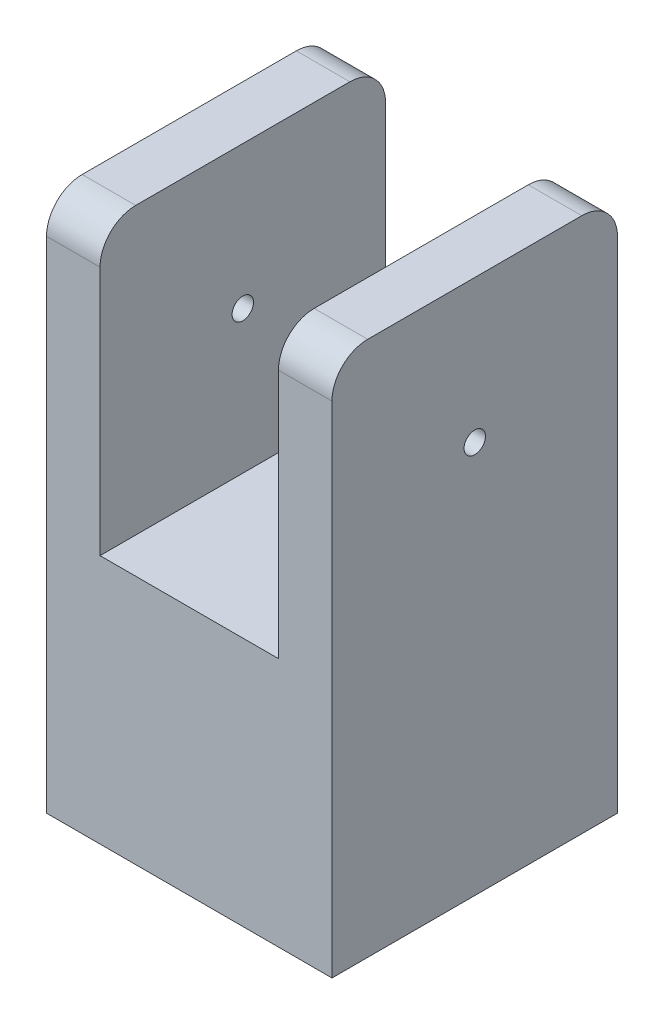
ISO-10303-21;
HEADER;
FILE_DESCRIPTION(('STEP AP214'),'2;1');
FILE_NAME('part.step','',(''),(''),'','','');
FILE_SCHEMA(('AUTOMOTIVE_DESIGN { 1 0 10303 214 1 1 1 1 }'));
ENDSEC;
DATA;
#1=APPLICATION_CONTEXT('core data for automotive mechanical design processes');
#2=APPLICATION_PROTOCOL_DEFINITION('international standard','automotive_design',2000,#1);
#3=PRODUCT_CONTEXT('',#1,'mechanical');
#4=PRODUCT('Part','Part','',(#3));
#5=PRODUCT_RELATED_PRODUCT_CATEGORY('part','',(#4));
#6=PRODUCT_DEFINITION_FORMATION('','',#4);
#7=PRODUCT_DEFINITION_CONTEXT('part definition',#1,'design');
#8=PRODUCT_DEFINITION('design','',#6,#7);
#9=PRODUCT_DEFINITION_SHAPE('','',#8);
#10=(LENGTH_UNIT() NAMED_UNIT(*) SI_UNIT(.MILLI.,.METRE.));
#11=(NAMED_UNIT(*) PLANE_ANGLE_UNIT() SI_UNIT($,.RADIAN.));
#12=(NAMED_UNIT(*) SI_UNIT($,.STERADIAN.) SOLID_ANGLE_UNIT());
#13=UNCERTAINTY_MEASURE_WITH_UNIT(LENGTH_MEASURE(1.E-05),#10,'distance_accuracy_value','');
#14=(GEOMETRIC_REPRESENTATION_CONTEXT(3) GLOBAL_UNCERTAINTY_ASSIGNED_CONTEXT((#13)) GLOBAL_UNIT_ASSIGNED_CONTEXT((#10,
#11,#12)) REPRESENTATION_CONTEXT('',''));
#15=CARTESIAN_POINT('',(0.,0.,0.));
#16=DIRECTION('',(0.,0.,1.));
#17=DIRECTION('',(1.,0.,0.));
#18=AXIS2_PLACEMENT_3D('',#15,#16,#17);
#19=CARTESIAN_POINT('',(0.,150.,0.));
#20=DIRECTION('',(0.,-1.,0.));
#21=DIRECTION('',(0.,0.,-1.));
#22=AXIS2_PLACEMENT_3D('',#19,#20,#21);
#23=PLANE('',#22);
#24=DIRECTION('',(0.,0.,1.));
#25=VECTOR('',#24,1.);
#26=CARTESIAN_POINT('',(-25.,150.,40.));
#27=LINE('',#26,#25);
#28=CARTESIAN_POINT('',(-25.,150.,-30.));
#29=VERTEX_POINT('',#28);
#30=CARTESIAN_POINT('',(-25.,150.,30.));
#31=VERTEX_POINT('',#30);
#32=EDGE_CURVE('E278',#29,#31,#27,.T.);
#33=ORIENTED_EDGE('',*,*,#32,.F.);
#34=DIRECTION('',(-1.,0.,0.));
#35=VECTOR('',#34,1.);
#36=CARTESIAN_POINT('',(0.,150.,-30.));
#37=LINE('',#36,#35);
#38=CARTESIAN_POINT('',(-40.,150.,-30.));
#39=VERTEX_POINT('',#38);
#40=EDGE_CURVE('E223',#29,#39,#37,.T.);
#41=ORIENTED_EDGE('',*,*,#40,.T.);
#42=DIRECTION('',(0.,0.,1.));
#43=VECTOR('',#42,1.);
#44=CARTESIAN_POINT('',(-40.,150.,40.));
#45=LINE('',#44,#43);
#46=CARTESIAN_POINT('',(-40.,150.,30.));
#47=VERTEX_POINT('',#46);
#48=EDGE_CURVE('E186',#39,#47,#45,.T.);
#49=ORIENTED_EDGE('',*,*,#48,.T.);
#50=DIRECTION('',(1.,0.,0.));
#51=VECTOR('',#50,1.);
#52=CARTESIAN_POINT('',(0.,150.,30.));
#53=LINE('',#52,#51);
#54=EDGE_CURVE('E211',#47,#31,#53,.T.);
#55=ORIENTED_EDGE('',*,*,#54,.T.);
#56=EDGE_LOOP('',(#33,#41,#49,#55));
#57=FACE_BOUND('',#56,.T.);
#58=ADVANCED_FACE('F47',(#57),#23,.F.);
#59=CARTESIAN_POINT('',(0.,150.,0.));
#60=DIRECTION('',(0.,-1.,0.));
#61=DIRECTION('',(0.,0.,-1.));
#62=AXIS2_PLACEMENT_3D('',#59,#60,#61);
#63=CYLINDRICAL_SURFACE('',#62,3.);
#64=CARTESIAN_POINT('',(0.,0.,0.));
#65=DIRECTION('',(0.,1.,0.));
#66=DIRECTION('',(0.,0.,1.));
#67=AXIS2_PLACEMENT_3D('',#64,#65,#66);
#68=CIRCLE('',#67,3.);
#69=CARTESIAN_POINT('',(0.,0.,3.));
#70=VERTEX_POINT('',#69);
#71=EDGE_CURVE('E177',#70,#70,#68,.T.);
#72=ORIENTED_EDGE('',*,*,#71,.F.);
#73=EDGE_LOOP('',(#72));
#74=FACE_BOUND('',#73,.T.);
#75=CARTESIAN_POINT('',(0.,70.,0.));
#76=DIRECTION('',(0.,1.,0.));
#77=DIRECTION('',(0.,0.,1.));
#78=AXIS2_PLACEMENT_3D('',#75,#76,#77);
#79=CIRCLE('',#78,3.);
#80=CARTESIAN_POINT('',(0.,70.,3.));
#81=VERTEX_POINT('',#80);
#82=EDGE_CURVE('E181',#81,#81,#79,.T.);
#83=ORIENTED_EDGE('',*,*,#82,.T.);
#84=EDGE_LOOP('',(#83));
#85=FACE_BOUND('',#84,.T.);
#86=ADVANCED_FACE('F315',(#74,#85),#63,.F.);
#87=DIRECTION('',(0.,0.,-1.));
#88=VECTOR('',#87,1.);
#89=CARTESIAN_POINT('',(40.,150.,40.));
#90=LINE('',#89,#88);
#91=CARTESIAN_POINT('',(40.,150.,30.));
#92=VERTEX_POINT('',#91);
#93=CARTESIAN_POINT('',(40.,150.,-30.));
#94=VERTEX_POINT('',#93);
#95=EDGE_CURVE('E182',#92,#94,#90,.T.);
#96=ORIENTED_EDGE('',*,*,#95,.T.);
#97=DIRECTION('',(-1.,0.,0.));
#98=VECTOR('',#97,1.);
#99=CARTESIAN_POINT('',(0.,150.,-30.));
#100=LINE('',#99,#98);
#101=CARTESIAN_POINT('',(25.,150.,-30.));
#102=VERTEX_POINT('',#101);
#103=EDGE_CURVE('E244',#94,#102,#100,.T.);
#104=ORIENTED_EDGE('',*,*,#103,.T.);
#105=DIRECTION('',(0.,0.,-1.));
#106=VECTOR('',#105,1.);
#107=CARTESIAN_POINT('',(25.,150.,40.));
#108=LINE('',#107,#106);
#109=CARTESIAN_POINT('',(25.,150.,30.));
#110=VERTEX_POINT('',#109);
#111=EDGE_CURVE('E268',#110,#102,#108,.T.);
#112=ORIENTED_EDGE('',*,*,#111,.F.);
#113=DIRECTION('',(1.,0.,0.));
#114=VECTOR('',#113,1.);
#115=CARTESIAN_POINT('',(0.,150.,30.));
#116=LINE('',#115,#114);
#117=EDGE_CURVE('E241',#110,#92,#116,.T.);
#118=ORIENTED_EDGE('',*,*,#117,.T.);
#119=EDGE_LOOP('',(#96,#104,#112,#118));
#120=FACE_BOUND('',#119,.T.);
#121=ADVANCED_FACE('F264',(#120),#23,.F.);
#122=CARTESIAN_POINT('',(0.,0.,0.));
#123=DIRECTION('',(0.,-1.,0.));
#124=DIRECTION('',(0.,0.,-1.));
#125=AXIS2_PLACEMENT_3D('',#122,#123,#124);
#126=PLANE('',#125);
#127=DIRECTION('',(0.,0.,-1.));
#128=VECTOR('',#127,1.);
#129=CARTESIAN_POINT('',(40.,0.,40.));
#130=LINE('',#129,#128);
#131=CARTESIAN_POINT('',(40.,0.,40.));
#132=VERTEX_POINT('',#131);
#133=CARTESIAN_POINT('',(40.,0.,-40.));
#134=VERTEX_POINT('',#133);
#135=EDGE_CURVE('E180',#132,#134,#130,.T.);
#136=ORIENTED_EDGE('',*,*,#135,.F.);
#137=DIRECTION('',(1.,0.,0.));
#138=VECTOR('',#137,1.);
#139=CARTESIAN_POINT('',(-40.,0.,40.));
#140=LINE('',#139,#138);
#141=CARTESIAN_POINT('',(-40.,0.,40.));
#142=VERTEX_POINT('',#141);
#143=EDGE_CURVE('E187',#142,#132,#140,.T.);
#144=ORIENTED_EDGE('',*,*,#143,.F.);
#145=DIRECTION('',(0.,0.,1.));
#146=VECTOR('',#145,1.);
#147=CARTESIAN_POINT('',(-40.,0.,40.));
#148=LINE('',#147,#146);
#149=CARTESIAN_POINT('',(-40.,0.,-40.));
#150=VERTEX_POINT('',#149);
#151=EDGE_CURVE('E197',#150,#142,#148,.T.);
#152=ORIENTED_EDGE('',*,*,#151,.F.);
#153=DIRECTION('',(-1.,0.,0.));
#154=VECTOR('',#153,1.);
#155=CARTESIAN_POINT('',(-40.,0.,-40.));
#156=LINE('',#155,#154);
#157=EDGE_CURVE('E194',#134,#150,#156,.T.);
#158=ORIENTED_EDGE('',*,*,#157,.F.);
#159=EDGE_LOOP('',(#136,#144,#152,#158));
#160=FACE_BOUND('',#159,.T.);
#161=ORIENTED_EDGE('',*,*,#71,.T.);
#162=EDGE_LOOP('',(#161));
#163=FACE_BOUND('',#162,.T.);
#164=ADVANCED_FACE('F307',(#160,#163),#126,.T.);
#165=CARTESIAN_POINT('',(40.,150.,40.));
#166=DIRECTION('',(-1.,0.,0.));
#167=DIRECTION('',(0.,0.,1.));
#168=AXIS2_PLACEMENT_3D('',#165,#166,#167);
#169=PLANE('',#168);
#170=CARTESIAN_POINT('',(40.,110.,0.));
#171=DIRECTION('',(-1.,0.,0.));
#172=DIRECTION('',(0.,0.,1.));
#173=AXIS2_PLACEMENT_3D('',#170,#171,#172);
#174=CIRCLE('',#173,3.);
#175=CARTESIAN_POINT('',(40.,110.,3.));
#176=VERTEX_POINT('',#175);
#177=EDGE_CURVE('E281',#176,#176,#174,.T.);
#178=ORIENTED_EDGE('',*,*,#177,.T.);
#179=EDGE_LOOP('',(#178));
#180=FACE_BOUND('',#179,.T.);
#181=DIRECTION('',(0.,-1.,0.));
#182=VECTOR('',#181,1.);
#183=CARTESIAN_POINT('',(40.,150.,-40.));
#184=LINE('',#183,#182);
#185=CARTESIAN_POINT('',(40.,140.,-40.));
#186=VERTEX_POINT('',#185);
#187=EDGE_CURVE('E208',#186,#134,#184,.T.);
#188=ORIENTED_EDGE('',*,*,#187,.F.);
#189=CARTESIAN_POINT('',(40.,140.,-30.));
#190=DIRECTION('',(-1.,0.,0.));
#191=DIRECTION('',(0.,0.,1.));
#192=AXIS2_PLACEMENT_3D('',#189,#190,#191);
#193=CIRCLE('',#192,10.);
#194=EDGE_CURVE('E254',#186,#94,#193,.F.);
#195=ORIENTED_EDGE('',*,*,#194,.T.);
#196=ORIENTED_EDGE('',*,*,#95,.F.);
#197=CARTESIAN_POINT('',(40.,140.,30.));
#198=DIRECTION('',(-1.,0.,0.));
#199=DIRECTION('',(0.,0.,1.));
#200=AXIS2_PLACEMENT_3D('',#197,#198,#199);
#201=CIRCLE('',#200,10.);
#202=CARTESIAN_POINT('',(40.,140.,40.));
#203=VERTEX_POINT('',#202);
#204=EDGE_CURVE('E63',#92,#203,#201,.F.);
#205=ORIENTED_EDGE('',*,*,#204,.T.);
#206=DIRECTION('',(0.,-1.,0.));
#207=VECTOR('',#206,1.);
#208=CARTESIAN_POINT('',(40.,150.,40.));
#209=LINE('',#208,#207);
#210=EDGE_CURVE('E191',#203,#132,#209,.T.);
#211=ORIENTED_EDGE('',*,*,#210,.T.);
#212=ORIENTED_EDGE('',*,*,#135,.T.);
#213=EDGE_LOOP('',(#188,#195,#196,#205,#211,#212));
#214=FACE_BOUND('',#213,.T.);
#215=ADVANCED_FACE('F259',(#180,#214),#169,.F.);
#216=CARTESIAN_POINT('',(-40.,150.,-40.));
#217=DIRECTION('',(0.,0.,1.));
#218=DIRECTION('',(1.,0.,0.));
#219=AXIS2_PLACEMENT_3D('',#216,#217,#218);
#220=PLANE('',#219);
#221=DIRECTION('',(0.,-1.,0.));
#222=VECTOR('',#221,1.);
#223=CARTESIAN_POINT('',(-40.,150.,-40.));
#224=LINE('',#223,#222);
#225=CARTESIAN_POINT('',(-40.,140.,-40.));
#226=VERTEX_POINT('',#225);
#227=EDGE_CURVE('E205',#226,#150,#224,.T.);
#228=ORIENTED_EDGE('',*,*,#227,.F.);
#229=DIRECTION('',(-1.,0.,0.));
#230=VECTOR('',#229,1.);
#231=CARTESIAN_POINT('',(-40.,140.,-40.));
#232=LINE('',#231,#230);
#233=CARTESIAN_POINT('',(-25.,140.,-40.));
#234=VERTEX_POINT('',#233);
#235=EDGE_CURVE('E234',#226,#234,#232,.F.);
#236=ORIENTED_EDGE('',*,*,#235,.T.);
#237=DIRECTION('',(0.,1.,0.));
#238=VECTOR('',#237,1.);
#239=CARTESIAN_POINT('',(-25.,70.,-40.));
#240=LINE('',#239,#238);
#241=CARTESIAN_POINT('',(-25.,70.,-40.));
#242=VERTEX_POINT('',#241);
#243=EDGE_CURVE('E171',#242,#234,#240,.T.);
#244=ORIENTED_EDGE('',*,*,#243,.F.);
#245=DIRECTION('',(-1.,0.,0.));
#246=VECTOR('',#245,1.);
#247=CARTESIAN_POINT('',(25.,70.,-40.));
#248=LINE('',#247,#246);
#249=CARTESIAN_POINT('',(25.,70.,-40.));
#250=VERTEX_POINT('',#249);
#251=EDGE_CURVE('E155',#250,#242,#248,.T.);
#252=ORIENTED_EDGE('',*,*,#251,.F.);
#253=DIRECTION('',(0.,1.,0.));
#254=VECTOR('',#253,1.);
#255=CARTESIAN_POINT('',(25.,70.,-40.));
#256=LINE('',#255,#254);
#257=CARTESIAN_POINT('',(25.,140.,-40.));
#258=VERTEX_POINT('',#257);
#259=EDGE_CURVE('E150',#250,#258,#256,.T.);
#260=ORIENTED_EDGE('',*,*,#259,.T.);
#261=DIRECTION('',(-1.,0.,0.));
#262=VECTOR('',#261,1.);
#263=CARTESIAN_POINT('',(-40.,140.,-40.));
#264=LINE('',#263,#262);
#265=EDGE_CURVE('E231',#258,#186,#264,.F.);
#266=ORIENTED_EDGE('',*,*,#265,.T.);
#267=ORIENTED_EDGE('',*,*,#187,.T.);
#268=ORIENTED_EDGE('',*,*,#157,.T.);
#269=EDGE_LOOP('',(#228,#236,#244,#252,#260,#266,#267,#268));
#270=FACE_BOUND('',#269,.T.);
#271=ADVANCED_FACE('F271',(#270),#220,.F.);
#272=CARTESIAN_POINT('',(-40.,150.,40.));
#273=DIRECTION('',(1.,0.,0.));
#274=DIRECTION('',(0.,0.,-1.));
#275=AXIS2_PLACEMENT_3D('',#272,#273,#274);
#276=PLANE('',#275);
#277=CARTESIAN_POINT('',(-40.,110.,0.));
#278=DIRECTION('',(1.,0.,0.));
#279=DIRECTION('',(0.,0.,-1.));
#280=AXIS2_PLACEMENT_3D('',#277,#278,#279);
#281=CIRCLE('',#280,3.);
#282=CARTESIAN_POINT('',(-40.,110.,-3.));
#283=VERTEX_POINT('',#282);
#284=EDGE_CURVE('E219',#283,#283,#281,.T.);
#285=ORIENTED_EDGE('',*,*,#284,.T.);
#286=EDGE_LOOP('',(#285));
#287=FACE_BOUND('',#286,.T.);
#288=ORIENTED_EDGE('',*,*,#48,.F.);
#289=CARTESIAN_POINT('',(-40.,140.,-30.));
#290=DIRECTION('',(1.,0.,0.));
#291=DIRECTION('',(0.,0.,-1.));
#292=AXIS2_PLACEMENT_3D('',#289,#290,#291);
#293=CIRCLE('',#292,10.);
#294=EDGE_CURVE('E229',#39,#226,#293,.F.);
#295=ORIENTED_EDGE('',*,*,#294,.T.);
#296=ORIENTED_EDGE('',*,*,#227,.T.);
#297=ORIENTED_EDGE('',*,*,#151,.T.);
#298=DIRECTION('',(0.,-1.,0.));
#299=VECTOR('',#298,1.);
#300=CARTESIAN_POINT('',(-40.,150.,40.));
#301=LINE('',#300,#299);
#302=CARTESIAN_POINT('',(-40.,140.,40.));
#303=VERTEX_POINT('',#302);
#304=EDGE_CURVE('E203',#303,#142,#301,.T.);
#305=ORIENTED_EDGE('',*,*,#304,.F.);
#306=CARTESIAN_POINT('',(-40.,140.,30.));
#307=DIRECTION('',(1.,0.,0.));
#308=DIRECTION('',(0.,0.,-1.));
#309=AXIS2_PLACEMENT_3D('',#306,#307,#308);
#310=CIRCLE('',#309,10.);
#311=EDGE_CURVE('E226',#303,#47,#310,.F.);
#312=ORIENTED_EDGE('',*,*,#311,.T.);
#313=EDGE_LOOP('',(#288,#295,#296,#297,#305,#312));
#314=FACE_BOUND('',#313,.T.);
#315=ADVANCED_FACE('F296',(#287,#314),#276,.F.);
#316=CARTESIAN_POINT('',(-40.,150.,40.));
#317=DIRECTION('',(0.,0.,-1.));
#318=DIRECTION('',(-1.,0.,0.));
#319=AXIS2_PLACEMENT_3D('',#316,#317,#318);
#320=PLANE('',#319);
#321=DIRECTION('',(0.,1.,0.));
#322=VECTOR('',#321,1.);
#323=CARTESIAN_POINT('',(-25.,70.,40.));
#324=LINE('',#323,#322);
#325=CARTESIAN_POINT('',(-25.,70.,40.));
#326=VERTEX_POINT('',#325);
#327=CARTESIAN_POINT('',(-25.,140.,40.));
#328=VERTEX_POINT('',#327);
#329=EDGE_CURVE('E167',#326,#328,#324,.T.);
#330=ORIENTED_EDGE('',*,*,#329,.T.);
#331=DIRECTION('',(1.,0.,0.));
#332=VECTOR('',#331,1.);
#333=CARTESIAN_POINT('',(-40.,140.,40.));
#334=LINE('',#333,#332);
#335=EDGE_CURVE('E11',#328,#303,#334,.F.);
#336=ORIENTED_EDGE('',*,*,#335,.T.);
#337=ORIENTED_EDGE('',*,*,#304,.T.);
#338=ORIENTED_EDGE('',*,*,#143,.T.);
#339=ORIENTED_EDGE('',*,*,#210,.F.);
#340=DIRECTION('',(1.,0.,0.));
#341=VECTOR('',#340,1.);
#342=CARTESIAN_POINT('',(-40.,140.,40.));
#343=LINE('',#342,#341);
#344=CARTESIAN_POINT('',(25.,140.,40.));
#345=VERTEX_POINT('',#344);
#346=EDGE_CURVE('E56',#203,#345,#343,.F.);
#347=ORIENTED_EDGE('',*,*,#346,.T.);
#348=DIRECTION('',(0.,1.,0.));
#349=VECTOR('',#348,1.);
#350=CARTESIAN_POINT('',(25.,70.,40.));
#351=LINE('',#350,#349);
#352=CARTESIAN_POINT('',(25.,70.,40.));
#353=VERTEX_POINT('',#352);
#354=EDGE_CURVE('E147',#353,#345,#351,.T.);
#355=ORIENTED_EDGE('',*,*,#354,.F.);
#356=DIRECTION('',(1.,0.,0.));
#357=VECTOR('',#356,1.);
#358=CARTESIAN_POINT('',(25.,70.,40.));
#359=LINE('',#358,#357);
#360=EDGE_CURVE('E156',#326,#353,#359,.T.);
#361=ORIENTED_EDGE('',*,*,#360,.F.);
#362=EDGE_LOOP('',(#330,#336,#337,#338,#339,#347,#355,#361));
#363=FACE_BOUND('',#362,.T.);
#364=ADVANCED_FACE('F165',(#363),#320,.F.);
#365=CARTESIAN_POINT('',(-25.,70.,40.));
#366=DIRECTION('',(-1.,0.,0.));
#367=DIRECTION('',(0.,0.,1.));
#368=AXIS2_PLACEMENT_3D('',#365,#366,#367);
#369=PLANE('',#368);
#370=CARTESIAN_POINT('',(-25.,110.,0.));
#371=DIRECTION('',(-1.,0.,0.));
#372=DIRECTION('',(0.,0.,1.));
#373=AXIS2_PLACEMENT_3D('',#370,#371,#372);
#374=CIRCLE('',#373,3.);
#375=CARTESIAN_POINT('',(-25.,110.,3.));
#376=VERTEX_POINT('',#375);
#377=EDGE_CURVE('E218',#376,#376,#374,.T.);
#378=ORIENTED_EDGE('',*,*,#377,.T.);
#379=EDGE_LOOP('',(#378));
#380=FACE_BOUND('',#379,.T.);
#381=ORIENTED_EDGE('',*,*,#243,.T.);
#382=CARTESIAN_POINT('',(-25.,140.,-30.));
#383=DIRECTION('',(-1.,0.,0.));
#384=DIRECTION('',(0.,0.,1.));
#385=AXIS2_PLACEMENT_3D('',#382,#383,#384);
#386=CIRCLE('',#385,10.);
#387=EDGE_CURVE('E239',#234,#29,#386,.F.);
#388=ORIENTED_EDGE('',*,*,#387,.T.);
#389=ORIENTED_EDGE('',*,*,#32,.T.);
#390=CARTESIAN_POINT('',(-25.,140.,30.));
#391=DIRECTION('',(-1.,0.,0.));
#392=DIRECTION('',(0.,0.,1.));
#393=AXIS2_PLACEMENT_3D('',#390,#391,#392);
#394=CIRCLE('',#393,10.);
#395=EDGE_CURVE('E236',#31,#328,#394,.F.);
#396=ORIENTED_EDGE('',*,*,#395,.T.);
#397=ORIENTED_EDGE('',*,*,#329,.F.);
#398=DIRECTION('',(0.,0.,1.));
#399=VECTOR('',#398,1.);
#400=CARTESIAN_POINT('',(-25.,70.,40.));
#401=LINE('',#400,#399);
#402=EDGE_CURVE('E160',#242,#326,#401,.T.);
#403=ORIENTED_EDGE('',*,*,#402,.F.);
#404=EDGE_LOOP('',(#381,#388,#389,#396,#397,#403));
#405=FACE_BOUND('',#404,.T.);
#406=ADVANCED_FACE('F286',(#380,#405),#369,.F.);
#407=CARTESIAN_POINT('',(25.,70.,40.));
#408=DIRECTION('',(1.,0.,0.));
#409=DIRECTION('',(0.,0.,-1.));
#410=AXIS2_PLACEMENT_3D('',#407,#408,#409);
#411=PLANE('',#410);
#412=CARTESIAN_POINT('',(25.,110.,0.));
#413=DIRECTION('',(1.,0.,0.));
#414=DIRECTION('',(0.,0.,-1.));
#415=AXIS2_PLACEMENT_3D('',#412,#413,#414);
#416=CIRCLE('',#415,3.);
#417=CARTESIAN_POINT('',(25.,110.,-3.));
#418=VERTEX_POINT('',#417);
#419=EDGE_CURVE('E215',#418,#418,#416,.T.);
#420=ORIENTED_EDGE('',*,*,#419,.T.);
#421=EDGE_LOOP('',(#420));
#422=FACE_BOUND('',#421,.T.);
#423=ORIENTED_EDGE('',*,*,#111,.T.);
#424=CARTESIAN_POINT('',(25.,140.,-30.));
#425=DIRECTION('',(1.,0.,0.));
#426=DIRECTION('',(0.,0.,-1.));
#427=AXIS2_PLACEMENT_3D('',#424,#425,#426);
#428=CIRCLE('',#427,10.);
#429=EDGE_CURVE('E250',#102,#258,#428,.F.);
#430=ORIENTED_EDGE('',*,*,#429,.T.);
#431=ORIENTED_EDGE('',*,*,#259,.F.);
#432=DIRECTION('',(0.,0.,-1.));
#433=VECTOR('',#432,1.);
#434=CARTESIAN_POINT('',(25.,70.,40.));
#435=LINE('',#434,#433);
#436=EDGE_CURVE('E143',#353,#250,#435,.T.);
#437=ORIENTED_EDGE('',*,*,#436,.F.);
#438=ORIENTED_EDGE('',*,*,#354,.T.);
#439=CARTESIAN_POINT('',(25.,140.,30.));
#440=DIRECTION('',(1.,0.,0.));
#441=DIRECTION('',(0.,0.,-1.));
#442=AXIS2_PLACEMENT_3D('',#439,#440,#441);
#443=CIRCLE('',#442,10.);
#444=EDGE_CURVE('E248',#345,#110,#443,.F.);
#445=ORIENTED_EDGE('',*,*,#444,.T.);
#446=EDGE_LOOP('',(#423,#430,#431,#437,#438,#445));
#447=FACE_BOUND('',#446,.T.);
#448=ADVANCED_FACE('F146',(#422,#447),#411,.F.);
#449=CARTESIAN_POINT('',(0.,70.,0.));
#450=DIRECTION('',(0.,1.,0.));
#451=DIRECTION('',(0.,0.,1.));
#452=AXIS2_PLACEMENT_3D('',#449,#450,#451);
#453=PLANE('',#452);
#454=ORIENTED_EDGE('',*,*,#82,.F.);
#455=EDGE_LOOP('',(#454));
#456=FACE_BOUND('',#455,.T.);
#457=ORIENTED_EDGE('',*,*,#402,.T.);
#458=ORIENTED_EDGE('',*,*,#360,.T.);
#459=ORIENTED_EDGE('',*,*,#436,.T.);
#460=ORIENTED_EDGE('',*,*,#251,.T.);
#461=EDGE_LOOP('',(#457,#458,#459,#460));
#462=FACE_BOUND('',#461,.T.);
#463=ADVANCED_FACE('F159',(#456,#462),#453,.T.);
#464=CARTESIAN_POINT('',(-40.,110.,0.));
#465=DIRECTION('',(1.,0.,0.));
#466=DIRECTION('',(0.,0.,-1.));
#467=AXIS2_PLACEMENT_3D('',#464,#465,#466);
#468=CYLINDRICAL_SURFACE('',#467,3.);
#469=ORIENTED_EDGE('',*,*,#419,.F.);
#470=EDGE_LOOP('',(#469));
#471=FACE_BOUND('',#470,.T.);
#472=ORIENTED_EDGE('',*,*,#177,.F.);
#473=EDGE_LOOP('',(#472));
#474=FACE_BOUND('',#473,.T.);
#475=ADVANCED_FACE('F371',(#471,#474),#468,.F.);
#476=ORIENTED_EDGE('',*,*,#284,.F.);
#477=EDGE_LOOP('',(#476));
#478=FACE_BOUND('',#477,.T.);
#479=ORIENTED_EDGE('',*,*,#377,.F.);
#480=EDGE_LOOP('',(#479));
#481=FACE_BOUND('',#480,.T.);
#482=ADVANCED_FACE('F341',(#478,#481),#468,.F.);
#483=CARTESIAN_POINT('',(0.,140.,-30.));
#484=DIRECTION('',(-1.,0.,0.));
#485=DIRECTION('',(0.,0.,1.));
#486=AXIS2_PLACEMENT_3D('',#483,#484,#485);
#487=CYLINDRICAL_SURFACE('',#486,10.);
#488=ORIENTED_EDGE('',*,*,#387,.F.);
#489=ORIENTED_EDGE('',*,*,#235,.F.);
#490=ORIENTED_EDGE('',*,*,#294,.F.);
#491=ORIENTED_EDGE('',*,*,#40,.F.);
#492=EDGE_LOOP('',(#488,#489,#490,#491));
#493=FACE_BOUND('',#492,.T.);
#494=ADVANCED_FACE('F291',(#493),#487,.T.);
#495=CARTESIAN_POINT('',(0.,140.,-30.));
#496=DIRECTION('',(-1.,0.,0.));
#497=DIRECTION('',(0.,0.,1.));
#498=AXIS2_PLACEMENT_3D('',#495,#496,#497);
#499=CYLINDRICAL_SURFACE('',#498,10.);
#500=ORIENTED_EDGE('',*,*,#194,.F.);
#501=ORIENTED_EDGE('',*,*,#265,.F.);
#502=ORIENTED_EDGE('',*,*,#429,.F.);
#503=ORIENTED_EDGE('',*,*,#103,.F.);
#504=EDGE_LOOP('',(#500,#501,#502,#503));
#505=FACE_BOUND('',#504,.T.);
#506=ADVANCED_FACE('F267',(#505),#499,.T.);
#507=CARTESIAN_POINT('',(0.,140.,30.));
#508=DIRECTION('',(1.,0.,0.));
#509=DIRECTION('',(0.,0.,-1.));
#510=AXIS2_PLACEMENT_3D('',#507,#508,#509);
#511=CYLINDRICAL_SURFACE('',#510,10.);
#512=ORIENTED_EDGE('',*,*,#311,.F.);
#513=ORIENTED_EDGE('',*,*,#335,.F.);
#514=ORIENTED_EDGE('',*,*,#395,.F.);
#515=ORIENTED_EDGE('',*,*,#54,.F.);
#516=EDGE_LOOP('',(#512,#513,#514,#515));
#517=FACE_BOUND('',#516,.T.);
#518=ADVANCED_FACE('F301',(#517),#511,.T.);
#519=CARTESIAN_POINT('',(0.,140.,30.));
#520=DIRECTION('',(1.,0.,0.));
#521=DIRECTION('',(0.,0.,-1.));
#522=AXIS2_PLACEMENT_3D('',#519,#520,#521);
#523=CYLINDRICAL_SURFACE('',#522,10.);
#524=ORIENTED_EDGE('',*,*,#444,.F.);
#525=ORIENTED_EDGE('',*,*,#346,.F.);
#526=ORIENTED_EDGE('',*,*,#204,.F.);
#527=ORIENTED_EDGE('',*,*,#117,.F.);
#528=EDGE_LOOP('',(#524,#525,#526,#527));
#529=FACE_BOUND('',#528,.T.);
#530=ADVANCED_FACE('F49',(#529),#523,.T.);
#531=CLOSED_SHELL('',(#58,#86,#121,#164,#215,#271,#315,#364,#406,#448,#463,#475,#482,#494,#506,
#518,#530));
#532=MANIFOLD_SOLID_BREP('B2',#531);
#533=ADVANCED_BREP_SHAPE_REPRESENTATION('',(#18,#532),#14);
#534=SHAPE_DEFINITION_REPRESENTATION(#9,#533);
ENDSEC;
END-ISO-10303-21;
